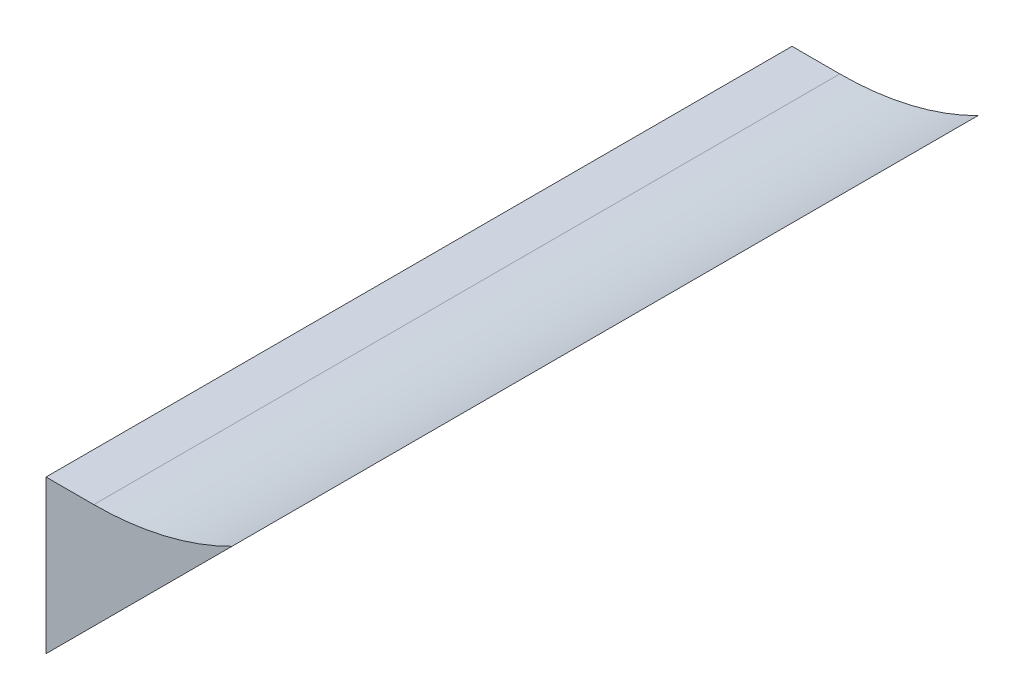
ISO-10303-21;
HEADER;
FILE_DESCRIPTION(('STEP AP214'),'2;1');
FILE_NAME('part.step','',(''),(''),'','','');
FILE_SCHEMA(('AUTOMOTIVE_DESIGN { 1 0 10303 214 1 1 1 1 }'));
ENDSEC;
DATA;
#1=APPLICATION_CONTEXT('core data for automotive mechanical design processes');
#2=APPLICATION_PROTOCOL_DEFINITION('international standard','automotive_design',2000,#1);
#3=PRODUCT_CONTEXT('',#1,'mechanical');
#4=PRODUCT('Part','Part','',(#3));
#5=PRODUCT_RELATED_PRODUCT_CATEGORY('part','',(#4));
#6=PRODUCT_DEFINITION_FORMATION('','',#4);
#7=PRODUCT_DEFINITION_CONTEXT('part definition',#1,'design');
#8=PRODUCT_DEFINITION('design','',#6,#7);
#9=PRODUCT_DEFINITION_SHAPE('','',#8);
#10=(LENGTH_UNIT() NAMED_UNIT(*) SI_UNIT(.MILLI.,.METRE.));
#11=(NAMED_UNIT(*) PLANE_ANGLE_UNIT() SI_UNIT($,.RADIAN.));
#12=(NAMED_UNIT(*) SI_UNIT($,.STERADIAN.) SOLID_ANGLE_UNIT());
#13=UNCERTAINTY_MEASURE_WITH_UNIT(LENGTH_MEASURE(1.E-05),#10,'distance_accuracy_value','');
#14=(GEOMETRIC_REPRESENTATION_CONTEXT(3) GLOBAL_UNCERTAINTY_ASSIGNED_CONTEXT((#13)) GLOBAL_UNIT_ASSIGNED_CONTEXT((#10,
#11,#12)) REPRESENTATION_CONTEXT('',''));
#15=CARTESIAN_POINT('',(0.,0.,0.));
#16=DIRECTION('',(0.,0.,1.));
#17=DIRECTION('',(1.,0.,0.));
#18=AXIS2_PLACEMENT_3D('',#15,#16,#17);
#19=CARTESIAN_POINT('',(-321.,15.9999999999999,-39.));
#20=DIRECTION('',(0.,0.,1.));
#21=DIRECTION('',(1.,0.,0.));
#22=AXIS2_PLACEMENT_3D('',#19,#20,#21);
#23=CYLINDRICAL_SURFACE('',#22,15.9999999438255);
#24=CARTESIAN_POINT('',(-321.,15.9999999999999,0.));
#25=DIRECTION('',(0.,0.,-1.));
#26=DIRECTION('',(1.,0.,0.));
#27=AXIS2_PLACEMENT_3D('',#24,#25,#26);
#28=CIRCLE('',#27,15.9999999438255);
#29=CARTESIAN_POINT('',(-313.776683740062,1.72331625993809,0.));
#30=VERTEX_POINT('',#29);
#31=CARTESIAN_POINT('',(-321.,-1.21430643318376E-13,0.));
#32=VERTEX_POINT('',#31);
#33=EDGE_CURVE('E96',#30,#32,#28,.T.);
#34=ORIENTED_EDGE('',*,*,#33,.F.);
#35=DIRECTION('',(0.,0.,1.));
#36=VECTOR('',#35,1.);
#37=CARTESIAN_POINT('',(-313.776683740062,1.72331625993809,-39.));
#38=LINE('',#37,#36);
#39=CARTESIAN_POINT('',(-313.776683740062,1.72331625993809,-39.));
#40=VERTEX_POINT('',#39);
#41=EDGE_CURVE('E11',#40,#30,#38,.T.);
#42=ORIENTED_EDGE('',*,*,#41,.F.);
#43=CARTESIAN_POINT('',(-321.,15.9999999999999,-39.));
#44=DIRECTION('',(0.,0.,-1.));
#45=DIRECTION('',(1.,0.,0.));
#46=AXIS2_PLACEMENT_3D('',#43,#44,#45);
#47=CIRCLE('',#46,15.9999999438255);
#48=CARTESIAN_POINT('',(-321.,-1.21430643318376E-13,-39.));
#49=VERTEX_POINT('',#48);
#50=EDGE_CURVE('E91',#40,#49,#47,.T.);
#51=ORIENTED_EDGE('',*,*,#50,.T.);
#52=DIRECTION('',(0.,0.,1.));
#53=VECTOR('',#52,1.);
#54=CARTESIAN_POINT('',(-321.,-1.21430643318376E-13,-39.));
#55=LINE('',#54,#53);
#56=EDGE_CURVE('E35',#49,#32,#55,.T.);
#57=ORIENTED_EDGE('',*,*,#56,.T.);
#58=EDGE_LOOP('',(#34,#42,#51,#57));
#59=FACE_BOUND('',#58,.T.);
#60=ADVANCED_FACE('F32',(#59),#23,.F.);
#61=CARTESIAN_POINT('',(-315.5,0.,-39.));
#62=DIRECTION('',(0.707106781186545,-0.70710678118655,0.));
#63=DIRECTION('',(0.70710678118655,0.707106781186545,0.));
#64=AXIS2_PLACEMENT_3D('',#61,#62,#63);
#65=PLANE('',#64);
#66=DIRECTION('',(0.70710678118655,0.707106781186545,0.));
#67=VECTOR('',#66,1.);
#68=CARTESIAN_POINT('',(-315.5,0.,0.));
#69=LINE('',#68,#67);
#70=CARTESIAN_POINT('',(-323.5,-8.00000000000002,0.));
#71=VERTEX_POINT('',#70);
#72=EDGE_CURVE('E63',#71,#30,#69,.T.);
#73=ORIENTED_EDGE('',*,*,#72,.F.);
#74=DIRECTION('',(0.,0.,1.));
#75=VECTOR('',#74,1.);
#76=CARTESIAN_POINT('',(-323.5,-8.00000000000002,-39.));
#77=LINE('',#76,#75);
#78=CARTESIAN_POINT('',(-323.5,-8.00000000000002,-39.));
#79=VERTEX_POINT('',#78);
#80=EDGE_CURVE('E41',#79,#71,#77,.T.);
#81=ORIENTED_EDGE('',*,*,#80,.F.);
#82=DIRECTION('',(0.707106781186552,0.707106781186543,0.));
#83=VECTOR('',#82,1.);
#84=CARTESIAN_POINT('',(-323.5,-8.00000000000002,-39.));
#85=LINE('',#84,#83);
#86=EDGE_CURVE('E49',#79,#40,#85,.T.);
#87=ORIENTED_EDGE('',*,*,#86,.T.);
#88=ORIENTED_EDGE('',*,*,#41,.T.);
#89=EDGE_LOOP('',(#73,#81,#87,#88));
#90=FACE_BOUND('',#89,.T.);
#91=ADVANCED_FACE('F107',(#90),#65,.T.);
#92=CARTESIAN_POINT('',(-323.5,0.,-39.));
#93=DIRECTION('',(-1.,0.,0.));
#94=DIRECTION('',(0.,0.,1.));
#95=AXIS2_PLACEMENT_3D('',#92,#93,#94);
#96=PLANE('',#95);
#97=DIRECTION('',(0.,-1.,0.));
#98=VECTOR('',#97,1.);
#99=CARTESIAN_POINT('',(-323.5,0.,0.));
#100=LINE('',#99,#98);
#101=CARTESIAN_POINT('',(-323.5,0.,0.));
#102=VERTEX_POINT('',#101);
#103=EDGE_CURVE('E82',#102,#71,#100,.T.);
#104=ORIENTED_EDGE('',*,*,#103,.F.);
#105=DIRECTION('',(0.,0.,1.));
#106=VECTOR('',#105,1.);
#107=CARTESIAN_POINT('',(-323.5,0.,-39.));
#108=LINE('',#107,#106);
#109=CARTESIAN_POINT('',(-323.5,0.,-39.));
#110=VERTEX_POINT('',#109);
#111=EDGE_CURVE('E77',#110,#102,#108,.T.);
#112=ORIENTED_EDGE('',*,*,#111,.F.);
#113=DIRECTION('',(0.,-1.,0.));
#114=VECTOR('',#113,1.);
#115=CARTESIAN_POINT('',(-323.5,0.,-39.));
#116=LINE('',#115,#114);
#117=EDGE_CURVE('E80',#110,#79,#116,.T.);
#118=ORIENTED_EDGE('',*,*,#117,.T.);
#119=ORIENTED_EDGE('',*,*,#80,.T.);
#120=EDGE_LOOP('',(#104,#112,#118,#119));
#121=FACE_BOUND('',#120,.T.);
#122=ADVANCED_FACE('F79',(#121),#96,.T.);
#123=CARTESIAN_POINT('',(-323.5,0.,-39.));
#124=DIRECTION('',(0.,1.,0.));
#125=DIRECTION('',(-1.,0.,0.));
#126=AXIS2_PLACEMENT_3D('',#123,#124,#125);
#127=PLANE('',#126);
#128=DIRECTION('',(-1.,0.,0.));
#129=VECTOR('',#128,1.);
#130=CARTESIAN_POINT('',(-323.5,0.,0.));
#131=LINE('',#130,#129);
#132=EDGE_CURVE('E99',#32,#102,#131,.T.);
#133=ORIENTED_EDGE('',*,*,#132,.F.);
#134=ORIENTED_EDGE('',*,*,#56,.F.);
#135=DIRECTION('',(-1.,0.,0.));
#136=VECTOR('',#135,1.);
#137=CARTESIAN_POINT('',(-323.5,0.,-39.));
#138=LINE('',#137,#136);
#139=EDGE_CURVE('E87',#49,#110,#138,.T.);
#140=ORIENTED_EDGE('',*,*,#139,.T.);
#141=ORIENTED_EDGE('',*,*,#111,.T.);
#142=EDGE_LOOP('',(#133,#134,#140,#141));
#143=FACE_BOUND('',#142,.T.);
#144=ADVANCED_FACE('F90',(#143),#127,.T.);
#145=CARTESIAN_POINT('',(-321.,15.9999999999999,-39.));
#146=DIRECTION('',(0.,0.,1.));
#147=DIRECTION('',(1.,0.,0.));
#148=AXIS2_PLACEMENT_3D('',#145,#146,#147);
#149=PLANE('',#148);
#150=ORIENTED_EDGE('',*,*,#50,.F.);
#151=ORIENTED_EDGE('',*,*,#86,.F.);
#152=ORIENTED_EDGE('',*,*,#117,.F.);
#153=ORIENTED_EDGE('',*,*,#139,.F.);
#154=EDGE_LOOP('',(#150,#151,#152,#153));
#155=FACE_BOUND('',#154,.T.);
#156=ADVANCED_FACE('F86',(#155),#149,.F.);
#157=CARTESIAN_POINT('',(-321.,15.9999999999999,0.));
#158=DIRECTION('',(0.,0.,1.));
#159=DIRECTION('',(1.,0.,0.));
#160=AXIS2_PLACEMENT_3D('',#157,#158,#159);
#161=PLANE('',#160);
#162=ORIENTED_EDGE('',*,*,#33,.T.);
#163=ORIENTED_EDGE('',*,*,#132,.T.);
#164=ORIENTED_EDGE('',*,*,#103,.T.);
#165=ORIENTED_EDGE('',*,*,#72,.T.);
#166=EDGE_LOOP('',(#162,#163,#164,#165));
#167=FACE_BOUND('',#166,.T.);
#168=ADVANCED_FACE('F104',(#167),#161,.T.);
#169=CLOSED_SHELL('',(#60,#91,#122,#144,#156,#168));
#170=MANIFOLD_SOLID_BREP('B2',#169);
#171=ADVANCED_BREP_SHAPE_REPRESENTATION('',(#18,#170),#14);
#172=SHAPE_DEFINITION_REPRESENTATION(#9,#171);
ENDSEC;
END-ISO-10303-21;
